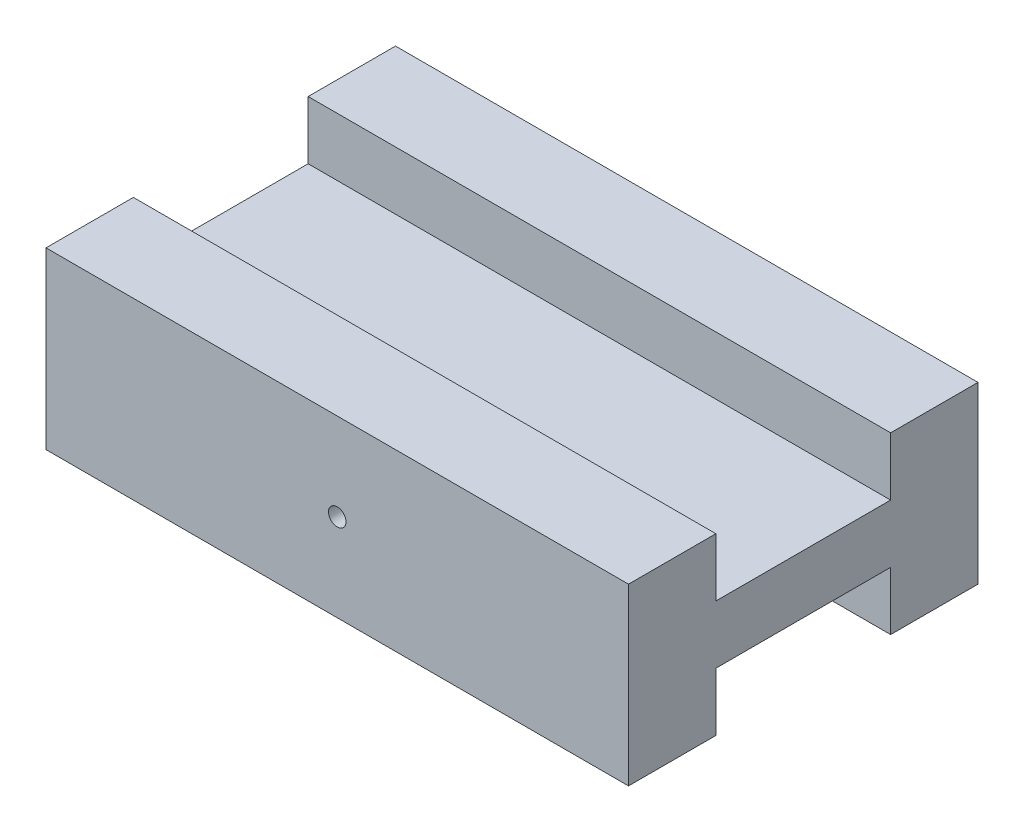
ISO-10303-21;
HEADER;
FILE_DESCRIPTION(('STEP AP214'),'2;1');
FILE_NAME('part.step','',(''),(''),'','','');
FILE_SCHEMA(('AUTOMOTIVE_DESIGN { 1 0 10303 214 1 1 1 1 }'));
ENDSEC;
DATA;
#1=APPLICATION_CONTEXT('core data for automotive mechanical design processes');
#2=APPLICATION_PROTOCOL_DEFINITION('international standard','automotive_design',2000,#1);
#3=PRODUCT_CONTEXT('',#1,'mechanical');
#4=PRODUCT('Part','Part','',(#3));
#5=PRODUCT_RELATED_PRODUCT_CATEGORY('part','',(#4));
#6=PRODUCT_DEFINITION_FORMATION('','',#4);
#7=PRODUCT_DEFINITION_CONTEXT('part definition',#1,'design');
#8=PRODUCT_DEFINITION('design','',#6,#7);
#9=PRODUCT_DEFINITION_SHAPE('','',#8);
#10=(LENGTH_UNIT() NAMED_UNIT(*) SI_UNIT(.MILLI.,.METRE.));
#11=(NAMED_UNIT(*) PLANE_ANGLE_UNIT() SI_UNIT($,.RADIAN.));
#12=(NAMED_UNIT(*) SI_UNIT($,.STERADIAN.) SOLID_ANGLE_UNIT());
#13=UNCERTAINTY_MEASURE_WITH_UNIT(LENGTH_MEASURE(1.E-05),#10,'distance_accuracy_value','');
#14=(GEOMETRIC_REPRESENTATION_CONTEXT(3) GLOBAL_UNCERTAINTY_ASSIGNED_CONTEXT((#13)) GLOBAL_UNIT_ASSIGNED_CONTEXT((#10,
#11,#12)) REPRESENTATION_CONTEXT('',''));
#15=CARTESIAN_POINT('',(0.,0.,0.));
#16=DIRECTION('',(0.,0.,1.));
#17=DIRECTION('',(1.,0.,0.));
#18=AXIS2_PLACEMENT_3D('',#15,#16,#17);
#19=CARTESIAN_POINT('',(0.,0.,0.));
#20=DIRECTION('',(0.,-1.,0.));
#21=DIRECTION('',(0.,0.,-1.));
#22=AXIS2_PLACEMENT_3D('',#19,#20,#21);
#23=PLANE('',#22);
#24=DIRECTION('',(1.,0.,0.));
#25=VECTOR('',#24,1.);
#26=CARTESIAN_POINT('',(50.,0.,-22.5));
#27=LINE('',#26,#25);
#28=CARTESIAN_POINT('',(0.,0.,-22.5));
#29=VERTEX_POINT('',#28);
#30=CARTESIAN_POINT('',(50.,0.,-22.5));
#31=VERTEX_POINT('',#30);
#32=EDGE_CURVE('E133',#29,#31,#27,.T.);
#33=ORIENTED_EDGE('',*,*,#32,.F.);
#34=DIRECTION('',(0.,0.,1.));
#35=VECTOR('',#34,1.);
#36=CARTESIAN_POINT('',(0.,0.,0.));
#37=LINE('',#36,#35);
#38=CARTESIAN_POINT('',(0.,0.,-30.));
#39=VERTEX_POINT('',#38);
#40=EDGE_CURVE('E203',#39,#29,#37,.T.);
#41=ORIENTED_EDGE('',*,*,#40,.F.);
#42=DIRECTION('',(-1.,0.,0.));
#43=VECTOR('',#42,1.);
#44=CARTESIAN_POINT('',(0.,0.,-30.));
#45=LINE('',#44,#43);
#46=CARTESIAN_POINT('',(50.,0.,-30.));
#47=VERTEX_POINT('',#46);
#48=EDGE_CURVE('E211',#47,#39,#45,.T.);
#49=ORIENTED_EDGE('',*,*,#48,.F.);
#50=DIRECTION('',(0.,0.,-1.));
#51=VECTOR('',#50,1.);
#52=CARTESIAN_POINT('',(50.,0.,0.));
#53=LINE('',#52,#51);
#54=EDGE_CURVE('E208',#31,#47,#53,.T.);
#55=ORIENTED_EDGE('',*,*,#54,.F.);
#56=EDGE_LOOP('',(#33,#41,#49,#55));
#57=FACE_BOUND('',#56,.T.);
#58=ADVANCED_FACE('F39',(#57),#23,.T.);
#59=CARTESIAN_POINT('',(0.,15.,0.));
#60=DIRECTION('',(0.,-1.,0.));
#61=DIRECTION('',(0.,0.,-1.));
#62=AXIS2_PLACEMENT_3D('',#59,#60,#61);
#63=PLANE('',#62);
#64=DIRECTION('',(0.,0.,1.));
#65=VECTOR('',#64,1.);
#66=CARTESIAN_POINT('',(0.,15.,0.));
#67=LINE('',#66,#65);
#68=CARTESIAN_POINT('',(0.,15.,-30.));
#69=VERTEX_POINT('',#68);
#70=CARTESIAN_POINT('',(0.,15.,-22.5));
#71=VERTEX_POINT('',#70);
#72=EDGE_CURVE('E190',#69,#71,#67,.T.);
#73=ORIENTED_EDGE('',*,*,#72,.T.);
#74=DIRECTION('',(-1.,0.,0.));
#75=VECTOR('',#74,1.);
#76=CARTESIAN_POINT('',(0.,15.,-22.5));
#77=LINE('',#76,#75);
#78=CARTESIAN_POINT('',(50.,15.,-22.5));
#79=VERTEX_POINT('',#78);
#80=EDGE_CURVE('E170',#79,#71,#77,.T.);
#81=ORIENTED_EDGE('',*,*,#80,.F.);
#82=DIRECTION('',(0.,0.,-1.));
#83=VECTOR('',#82,1.);
#84=CARTESIAN_POINT('',(50.,15.,0.));
#85=LINE('',#84,#83);
#86=CARTESIAN_POINT('',(50.,15.,-30.));
#87=VERTEX_POINT('',#86);
#88=EDGE_CURVE('E196',#79,#87,#85,.T.);
#89=ORIENTED_EDGE('',*,*,#88,.T.);
#90=DIRECTION('',(-1.,0.,0.));
#91=VECTOR('',#90,1.);
#92=CARTESIAN_POINT('',(0.,15.,-30.));
#93=LINE('',#92,#91);
#94=EDGE_CURVE('E200',#87,#69,#93,.T.);
#95=ORIENTED_EDGE('',*,*,#94,.T.);
#96=EDGE_LOOP('',(#73,#81,#89,#95));
#97=FACE_BOUND('',#96,.T.);
#98=ADVANCED_FACE('F241',(#97),#63,.F.);
#99=CARTESIAN_POINT('',(0.,15.,0.));
#100=DIRECTION('',(1.,0.,0.));
#101=DIRECTION('',(0.,0.,-1.));
#102=AXIS2_PLACEMENT_3D('',#99,#100,#101);
#103=PLANE('',#102);
#104=ORIENTED_EDGE('',*,*,#40,.T.);
#105=DIRECTION('',(0.,-1.,0.));
#106=VECTOR('',#105,1.);
#107=CARTESIAN_POINT('',(0.,5.,-22.5));
#108=LINE('',#107,#106);
#109=CARTESIAN_POINT('',(0.,5.,-22.5));
#110=VERTEX_POINT('',#109);
#111=EDGE_CURVE('E159',#110,#29,#108,.T.);
#112=ORIENTED_EDGE('',*,*,#111,.F.);
#113=DIRECTION('',(0.,0.,-1.));
#114=VECTOR('',#113,1.);
#115=CARTESIAN_POINT('',(0.,5.,-22.5));
#116=LINE('',#115,#114);
#117=CARTESIAN_POINT('',(0.,5.,-7.5));
#118=VERTEX_POINT('',#117);
#119=EDGE_CURVE('E137',#118,#110,#116,.T.);
#120=ORIENTED_EDGE('',*,*,#119,.F.);
#121=DIRECTION('',(0.,-1.,0.));
#122=VECTOR('',#121,1.);
#123=CARTESIAN_POINT('',(0.,5.,-7.5));
#124=LINE('',#123,#122);
#125=CARTESIAN_POINT('',(0.,0.,-7.5));
#126=VERTEX_POINT('',#125);
#127=EDGE_CURVE('E162',#118,#126,#124,.T.);
#128=ORIENTED_EDGE('',*,*,#127,.T.);
#129=CARTESIAN_POINT('',(0.,0.,0.));
#130=VERTEX_POINT('',#129);
#131=EDGE_CURVE('E183',#126,#130,#37,.T.);
#132=ORIENTED_EDGE('',*,*,#131,.T.);
#133=DIRECTION('',(0.,-1.,0.));
#134=VECTOR('',#133,1.);
#135=CARTESIAN_POINT('',(0.,15.,0.));
#136=LINE('',#135,#134);
#137=CARTESIAN_POINT('',(0.,15.,0.));
#138=VERTEX_POINT('',#137);
#139=EDGE_CURVE('E11',#138,#130,#136,.T.);
#140=ORIENTED_EDGE('',*,*,#139,.F.);
#141=CARTESIAN_POINT('',(0.,15.,-7.5));
#142=VERTEX_POINT('',#141);
#143=EDGE_CURVE('E194',#142,#138,#67,.T.);
#144=ORIENTED_EDGE('',*,*,#143,.F.);
#145=DIRECTION('',(0.,1.,0.));
#146=VECTOR('',#145,1.);
#147=CARTESIAN_POINT('',(0.,10.,-7.5));
#148=LINE('',#147,#146);
#149=CARTESIAN_POINT('',(0.,10.,-7.5));
#150=VERTEX_POINT('',#149);
#151=EDGE_CURVE('E62',#150,#142,#148,.T.);
#152=ORIENTED_EDGE('',*,*,#151,.F.);
#153=DIRECTION('',(0.,0.,1.));
#154=VECTOR('',#153,1.);
#155=CARTESIAN_POINT('',(0.,10.,-22.5));
#156=LINE('',#155,#154);
#157=CARTESIAN_POINT('',(0.,10.,-22.5));
#158=VERTEX_POINT('',#157);
#159=EDGE_CURVE('E166',#158,#150,#156,.T.);
#160=ORIENTED_EDGE('',*,*,#159,.F.);
#161=DIRECTION('',(0.,1.,0.));
#162=VECTOR('',#161,1.);
#163=CARTESIAN_POINT('',(0.,10.,-22.5));
#164=LINE('',#163,#162);
#165=EDGE_CURVE('E180',#158,#71,#164,.T.);
#166=ORIENTED_EDGE('',*,*,#165,.T.);
#167=ORIENTED_EDGE('',*,*,#72,.F.);
#168=DIRECTION('',(0.,-1.,0.));
#169=VECTOR('',#168,1.);
#170=CARTESIAN_POINT('',(0.,15.,-30.));
#171=LINE('',#170,#169);
#172=EDGE_CURVE('E202',#69,#39,#171,.T.);
#173=ORIENTED_EDGE('',*,*,#172,.T.);
#174=EDGE_LOOP('',(#104,#112,#120,#128,#132,#140,#144,#152,#160,#166,#167,#173));
#175=FACE_BOUND('',#174,.T.);
#176=ADVANCED_FACE('F41',(#175),#103,.F.);
#177=CARTESIAN_POINT('',(0.,15.,0.));
#178=DIRECTION('',(0.,0.,-1.));
#179=DIRECTION('',(-1.,0.,0.));
#180=AXIS2_PLACEMENT_3D('',#177,#178,#179);
#181=PLANE('',#180);
#182=CARTESIAN_POINT('',(25.,7.5,0.));
#183=DIRECTION('',(0.,0.,1.));
#184=DIRECTION('',(1.,0.,0.));
#185=AXIS2_PLACEMENT_3D('',#182,#183,#184);
#186=CIRCLE('',#185,0.750000000000002);
#187=CARTESIAN_POINT('',(25.75,7.5,0.));
#188=VERTEX_POINT('',#187);
#189=EDGE_CURVE('E301',#188,#188,#186,.T.);
#190=ORIENTED_EDGE('',*,*,#189,.F.);
#191=EDGE_LOOP('',(#190));
#192=FACE_BOUND('',#191,.T.);
#193=DIRECTION('',(1.,0.,0.));
#194=VECTOR('',#193,1.);
#195=CARTESIAN_POINT('',(0.,0.,0.));
#196=LINE('',#195,#194);
#197=CARTESIAN_POINT('',(50.,0.,0.));
#198=VERTEX_POINT('',#197);
#199=EDGE_CURVE('E206',#130,#198,#196,.T.);
#200=ORIENTED_EDGE('',*,*,#199,.T.);
#201=DIRECTION('',(0.,-1.,0.));
#202=VECTOR('',#201,1.);
#203=CARTESIAN_POINT('',(50.,15.,0.));
#204=LINE('',#203,#202);
#205=CARTESIAN_POINT('',(50.,15.,0.));
#206=VERTEX_POINT('',#205);
#207=EDGE_CURVE('E47',#206,#198,#204,.T.);
#208=ORIENTED_EDGE('',*,*,#207,.F.);
#209=DIRECTION('',(1.,0.,0.));
#210=VECTOR('',#209,1.);
#211=CARTESIAN_POINT('',(0.,15.,0.));
#212=LINE('',#211,#210);
#213=EDGE_CURVE('E193',#138,#206,#212,.T.);
#214=ORIENTED_EDGE('',*,*,#213,.F.);
#215=ORIENTED_EDGE('',*,*,#139,.T.);
#216=EDGE_LOOP('',(#200,#208,#214,#215));
#217=FACE_BOUND('',#216,.T.);
#218=ADVANCED_FACE('F254',(#192,#217),#181,.F.);
#219=CARTESIAN_POINT('',(50.,15.,0.));
#220=DIRECTION('',(-1.,0.,0.));
#221=DIRECTION('',(0.,0.,1.));
#222=AXIS2_PLACEMENT_3D('',#219,#220,#221);
#223=PLANE('',#222);
#224=DIRECTION('',(0.,0.,1.));
#225=VECTOR('',#224,1.);
#226=CARTESIAN_POINT('',(50.,5.,-7.5));
#227=LINE('',#226,#225);
#228=CARTESIAN_POINT('',(50.,5.,-22.5));
#229=VERTEX_POINT('',#228);
#230=CARTESIAN_POINT('',(50.,5.,-7.5));
#231=VERTEX_POINT('',#230);
#232=EDGE_CURVE('E143',#229,#231,#227,.T.);
#233=ORIENTED_EDGE('',*,*,#232,.F.);
#234=DIRECTION('',(0.,-1.,0.));
#235=VECTOR('',#234,1.);
#236=CARTESIAN_POINT('',(50.,5.,-22.5));
#237=LINE('',#236,#235);
#238=EDGE_CURVE('E127',#229,#31,#237,.T.);
#239=ORIENTED_EDGE('',*,*,#238,.T.);
#240=ORIENTED_EDGE('',*,*,#54,.T.);
#241=DIRECTION('',(0.,-1.,0.));
#242=VECTOR('',#241,1.);
#243=CARTESIAN_POINT('',(50.,15.,-30.));
#244=LINE('',#243,#242);
#245=EDGE_CURVE('E215',#87,#47,#244,.T.);
#246=ORIENTED_EDGE('',*,*,#245,.F.);
#247=ORIENTED_EDGE('',*,*,#88,.F.);
#248=DIRECTION('',(0.,1.,0.));
#249=VECTOR('',#248,1.);
#250=CARTESIAN_POINT('',(50.,10.,-22.5));
#251=LINE('',#250,#249);
#252=CARTESIAN_POINT('',(50.,10.,-22.5));
#253=VERTEX_POINT('',#252);
#254=EDGE_CURVE('E184',#253,#79,#251,.T.);
#255=ORIENTED_EDGE('',*,*,#254,.F.);
#256=DIRECTION('',(0.,0.,-1.));
#257=VECTOR('',#256,1.);
#258=CARTESIAN_POINT('',(50.,10.,-22.5));
#259=LINE('',#258,#257);
#260=CARTESIAN_POINT('',(50.,10.,-7.5));
#261=VERTEX_POINT('',#260);
#262=EDGE_CURVE('E173',#261,#253,#259,.T.);
#263=ORIENTED_EDGE('',*,*,#262,.F.);
#264=DIRECTION('',(0.,1.,0.));
#265=VECTOR('',#264,1.);
#266=CARTESIAN_POINT('',(50.,10.,-7.5));
#267=LINE('',#266,#265);
#268=CARTESIAN_POINT('',(50.,15.,-7.5));
#269=VERTEX_POINT('',#268);
#270=EDGE_CURVE('E186',#261,#269,#267,.T.);
#271=ORIENTED_EDGE('',*,*,#270,.T.);
#272=EDGE_CURVE('E197',#206,#269,#85,.T.);
#273=ORIENTED_EDGE('',*,*,#272,.F.);
#274=ORIENTED_EDGE('',*,*,#207,.T.);
#275=CARTESIAN_POINT('',(50.,0.,-7.5));
#276=VERTEX_POINT('',#275);
#277=EDGE_CURVE('E209',#198,#276,#53,.T.);
#278=ORIENTED_EDGE('',*,*,#277,.T.);
#279=DIRECTION('',(0.,-1.,0.));
#280=VECTOR('',#279,1.);
#281=CARTESIAN_POINT('',(50.,5.,-7.5));
#282=LINE('',#281,#280);
#283=EDGE_CURVE('E54',#231,#276,#282,.T.);
#284=ORIENTED_EDGE('',*,*,#283,.F.);
#285=EDGE_LOOP('',(#233,#239,#240,#246,#247,#255,#263,#271,#273,#274,#278,#284));
#286=FACE_BOUND('',#285,.T.);
#287=ADVANCED_FACE('F148',(#286),#223,.F.);
#288=CARTESIAN_POINT('',(0.,15.,-30.));
#289=DIRECTION('',(0.,0.,1.));
#290=DIRECTION('',(1.,0.,0.));
#291=AXIS2_PLACEMENT_3D('',#288,#289,#290);
#292=PLANE('',#291);
#293=CARTESIAN_POINT('',(25.,7.5,-30.));
#294=DIRECTION('',(0.,0.,1.));
#295=DIRECTION('',(1.,0.,0.));
#296=AXIS2_PLACEMENT_3D('',#293,#294,#295);
#297=CIRCLE('',#296,0.750000000000002);
#298=CARTESIAN_POINT('',(25.75,7.5,-30.));
#299=VERTEX_POINT('',#298);
#300=EDGE_CURVE('E157',#299,#299,#297,.F.);
#301=ORIENTED_EDGE('',*,*,#300,.F.);
#302=EDGE_LOOP('',(#301));
#303=FACE_BOUND('',#302,.T.);
#304=ORIENTED_EDGE('',*,*,#48,.T.);
#305=ORIENTED_EDGE('',*,*,#172,.F.);
#306=ORIENTED_EDGE('',*,*,#94,.F.);
#307=ORIENTED_EDGE('',*,*,#245,.T.);
#308=EDGE_LOOP('',(#304,#305,#306,#307));
#309=FACE_BOUND('',#308,.T.);
#310=ADVANCED_FACE('F237',(#303,#309),#292,.F.);
#311=ORIENTED_EDGE('',*,*,#272,.T.);
#312=DIRECTION('',(1.,0.,0.));
#313=VECTOR('',#312,1.);
#314=CARTESIAN_POINT('',(0.,15.,-7.5));
#315=LINE('',#314,#313);
#316=EDGE_CURVE('E161',#142,#269,#315,.T.);
#317=ORIENTED_EDGE('',*,*,#316,.F.);
#318=ORIENTED_EDGE('',*,*,#143,.T.);
#319=ORIENTED_EDGE('',*,*,#213,.T.);
#320=EDGE_LOOP('',(#311,#317,#318,#319));
#321=FACE_BOUND('',#320,.T.);
#322=ADVANCED_FACE('F253',(#321),#63,.F.);
#323=DIRECTION('',(-1.,0.,0.));
#324=VECTOR('',#323,1.);
#325=CARTESIAN_POINT('',(0.,0.,-7.5));
#326=LINE('',#325,#324);
#327=EDGE_CURVE('E146',#276,#126,#326,.T.);
#328=ORIENTED_EDGE('',*,*,#327,.F.);
#329=ORIENTED_EDGE('',*,*,#277,.F.);
#330=ORIENTED_EDGE('',*,*,#199,.F.);
#331=ORIENTED_EDGE('',*,*,#131,.F.);
#332=EDGE_LOOP('',(#328,#329,#330,#331));
#333=FACE_BOUND('',#332,.T.);
#334=ADVANCED_FACE('F225',(#333),#23,.T.);
#335=CARTESIAN_POINT('',(0.,10.,-22.5));
#336=DIRECTION('',(0.,0.,-1.));
#337=DIRECTION('',(-1.,0.,0.));
#338=AXIS2_PLACEMENT_3D('',#335,#336,#337);
#339=PLANE('',#338);
#340=ORIENTED_EDGE('',*,*,#80,.T.);
#341=ORIENTED_EDGE('',*,*,#165,.F.);
#342=DIRECTION('',(-1.,0.,0.));
#343=VECTOR('',#342,1.);
#344=CARTESIAN_POINT('',(0.,10.,-22.5));
#345=LINE('',#344,#343);
#346=EDGE_CURVE('E175',#253,#158,#345,.T.);
#347=ORIENTED_EDGE('',*,*,#346,.F.);
#348=ORIENTED_EDGE('',*,*,#254,.T.);
#349=EDGE_LOOP('',(#340,#341,#347,#348));
#350=FACE_BOUND('',#349,.T.);
#351=ADVANCED_FACE('F247',(#350),#339,.F.);
#352=CARTESIAN_POINT('',(0.,10.,-7.5));
#353=DIRECTION('',(0.,0.,1.));
#354=DIRECTION('',(1.,0.,0.));
#355=AXIS2_PLACEMENT_3D('',#352,#353,#354);
#356=PLANE('',#355);
#357=ORIENTED_EDGE('',*,*,#316,.T.);
#358=ORIENTED_EDGE('',*,*,#270,.F.);
#359=DIRECTION('',(1.,0.,0.));
#360=VECTOR('',#359,1.);
#361=CARTESIAN_POINT('',(0.,10.,-7.5));
#362=LINE('',#361,#360);
#363=EDGE_CURVE('E169',#150,#261,#362,.T.);
#364=ORIENTED_EDGE('',*,*,#363,.F.);
#365=ORIENTED_EDGE('',*,*,#151,.T.);
#366=EDGE_LOOP('',(#357,#358,#364,#365));
#367=FACE_BOUND('',#366,.T.);
#368=ADVANCED_FACE('F278',(#367),#356,.F.);
#369=CARTESIAN_POINT('',(0.,10.,0.));
#370=DIRECTION('',(0.,1.,0.));
#371=DIRECTION('',(0.,0.,1.));
#372=AXIS2_PLACEMENT_3D('',#369,#370,#371);
#373=PLANE('',#372);
#374=ORIENTED_EDGE('',*,*,#159,.T.);
#375=ORIENTED_EDGE('',*,*,#363,.T.);
#376=ORIENTED_EDGE('',*,*,#262,.T.);
#377=ORIENTED_EDGE('',*,*,#346,.T.);
#378=EDGE_LOOP('',(#374,#375,#376,#377));
#379=FACE_BOUND('',#378,.T.);
#380=ADVANCED_FACE('F250',(#379),#373,.T.);
#381=CARTESIAN_POINT('',(50.,5.,-22.5));
#382=DIRECTION('',(0.,0.,-1.));
#383=DIRECTION('',(-1.,0.,0.));
#384=AXIS2_PLACEMENT_3D('',#381,#382,#383);
#385=PLANE('',#384);
#386=ORIENTED_EDGE('',*,*,#32,.T.);
#387=ORIENTED_EDGE('',*,*,#238,.F.);
#388=DIRECTION('',(1.,0.,0.));
#389=VECTOR('',#388,1.);
#390=CARTESIAN_POINT('',(50.,5.,-22.5));
#391=LINE('',#390,#389);
#392=EDGE_CURVE('E130',#110,#229,#391,.T.);
#393=ORIENTED_EDGE('',*,*,#392,.F.);
#394=ORIENTED_EDGE('',*,*,#111,.T.);
#395=EDGE_LOOP('',(#386,#387,#393,#394));
#396=FACE_BOUND('',#395,.T.);
#397=ADVANCED_FACE('F129',(#396),#385,.F.);
#398=CARTESIAN_POINT('',(0.,5.,-7.5));
#399=DIRECTION('',(0.,0.,1.));
#400=DIRECTION('',(1.,0.,0.));
#401=AXIS2_PLACEMENT_3D('',#398,#399,#400);
#402=PLANE('',#401);
#403=ORIENTED_EDGE('',*,*,#327,.T.);
#404=ORIENTED_EDGE('',*,*,#127,.F.);
#405=DIRECTION('',(-1.,0.,0.));
#406=VECTOR('',#405,1.);
#407=CARTESIAN_POINT('',(0.,5.,-7.5));
#408=LINE('',#407,#406);
#409=EDGE_CURVE('E150',#231,#118,#408,.T.);
#410=ORIENTED_EDGE('',*,*,#409,.F.);
#411=ORIENTED_EDGE('',*,*,#283,.T.);
#412=EDGE_LOOP('',(#403,#404,#410,#411));
#413=FACE_BOUND('',#412,.T.);
#414=ADVANCED_FACE('F227',(#413),#402,.F.);
#415=CARTESIAN_POINT('',(0.,5.,0.));
#416=DIRECTION('',(0.,1.,0.));
#417=DIRECTION('',(0.,0.,1.));
#418=AXIS2_PLACEMENT_3D('',#415,#416,#417);
#419=PLANE('',#418);
#420=ORIENTED_EDGE('',*,*,#392,.T.);
#421=ORIENTED_EDGE('',*,*,#232,.T.);
#422=ORIENTED_EDGE('',*,*,#409,.T.);
#423=ORIENTED_EDGE('',*,*,#119,.T.);
#424=EDGE_LOOP('',(#420,#421,#422,#423));
#425=FACE_BOUND('',#424,.T.);
#426=ADVANCED_FACE('F141',(#425),#419,.F.);
#427=CARTESIAN_POINT('',(25.,7.5,-32.1213203435596));
#428=DIRECTION('',(0.,0.,1.));
#429=DIRECTION('',(1.,0.,0.));
#430=AXIS2_PLACEMENT_3D('',#427,#428,#429);
#431=CYLINDRICAL_SURFACE('',#430,0.750000000000002);
#432=ORIENTED_EDGE('',*,*,#300,.T.);
#433=EDGE_LOOP('',(#432));
#434=FACE_BOUND('',#433,.T.);
#435=ORIENTED_EDGE('',*,*,#189,.T.);
#436=EDGE_LOOP('',(#435));
#437=FACE_BOUND('',#436,.T.);
#438=ADVANCED_FACE('F292',(#434,#437),#431,.F.);
#439=CLOSED_SHELL('',(#58,#98,#176,#218,#287,#310,#322,#334,#351,#368,#380,#397,#414,#426,#438));
#440=MANIFOLD_SOLID_BREP('B2',#439);
#441=ADVANCED_BREP_SHAPE_REPRESENTATION('',(#18,#440),#14);
#442=SHAPE_DEFINITION_REPRESENTATION(#9,#441);
ENDSEC;
END-ISO-10303-21;
